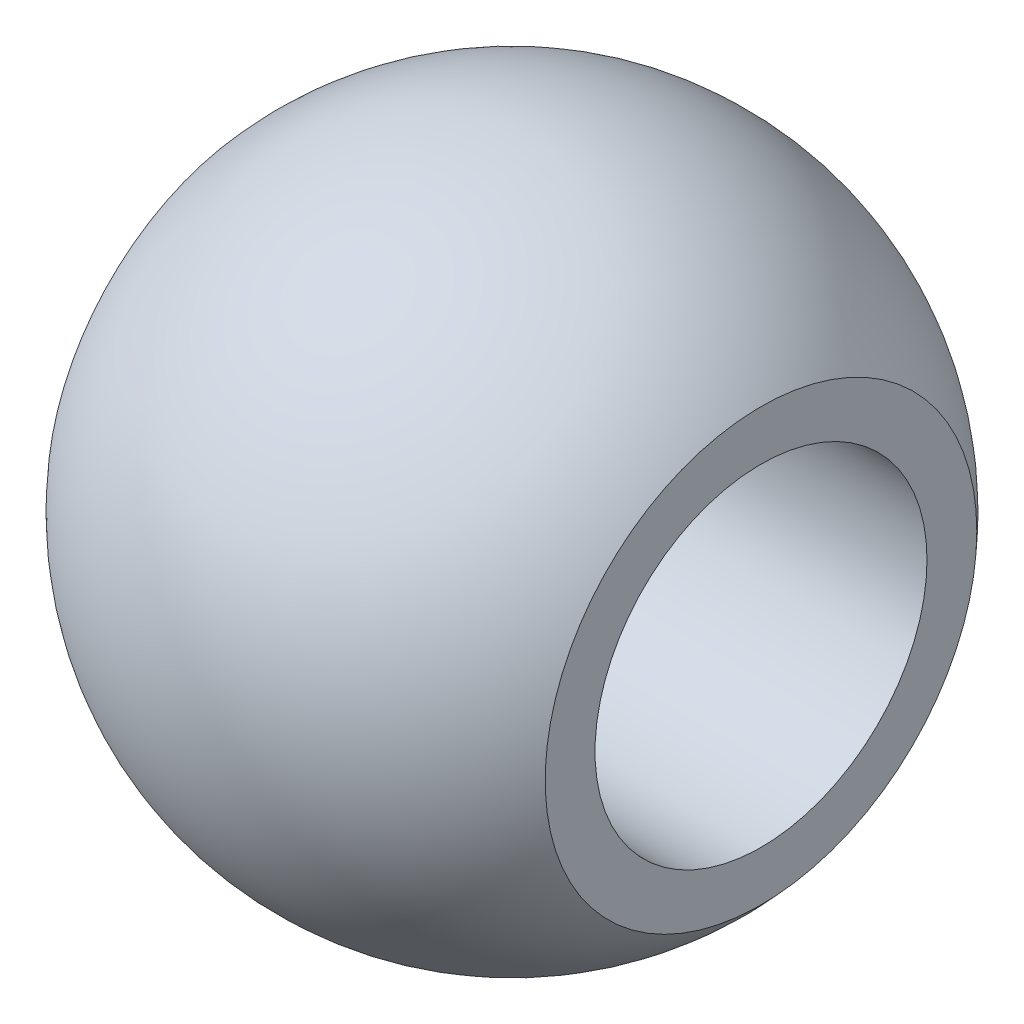
ISO-10303-21;
HEADER;
FILE_DESCRIPTION(('STEP AP214'),'2;1');
FILE_NAME('part.step','',(''),(''),'','','');
FILE_SCHEMA(('AUTOMOTIVE_DESIGN { 1 0 10303 214 1 1 1 1 }'));
ENDSEC;
DATA;
#1=APPLICATION_CONTEXT('core data for automotive mechanical design processes');
#2=APPLICATION_PROTOCOL_DEFINITION('international standard','automotive_design',2000,#1);
#3=PRODUCT_CONTEXT('',#1,'mechanical');
#4=PRODUCT('Part','Part','',(#3));
#5=PRODUCT_RELATED_PRODUCT_CATEGORY('part','',(#4));
#6=PRODUCT_DEFINITION_FORMATION('','',#4);
#7=PRODUCT_DEFINITION_CONTEXT('part definition',#1,'design');
#8=PRODUCT_DEFINITION('design','',#6,#7);
#9=PRODUCT_DEFINITION_SHAPE('','',#8);
#10=(LENGTH_UNIT() NAMED_UNIT(*) SI_UNIT(.MILLI.,.METRE.));
#11=(NAMED_UNIT(*) PLANE_ANGLE_UNIT() SI_UNIT($,.RADIAN.));
#12=(NAMED_UNIT(*) SI_UNIT($,.STERADIAN.) SOLID_ANGLE_UNIT());
#13=UNCERTAINTY_MEASURE_WITH_UNIT(LENGTH_MEASURE(1.E-05),#10,'distance_accuracy_value','');
#14=(GEOMETRIC_REPRESENTATION_CONTEXT(3) GLOBAL_UNCERTAINTY_ASSIGNED_CONTEXT((#13)) GLOBAL_UNIT_ASSIGNED_CONTEXT((#10,
#11,#12)) REPRESENTATION_CONTEXT('',''));
#15=CARTESIAN_POINT('',(0.,0.,0.));
#16=DIRECTION('',(0.,0.,1.));
#17=DIRECTION('',(1.,0.,0.));
#18=AXIS2_PLACEMENT_3D('',#15,#16,#17);
#19=CARTESIAN_POINT('',(6.,0.,-3.99999999999999));
#20=DIRECTION('',(1.,0.,0.));
#21=DIRECTION('',(0.,0.,-1.));
#22=AXIS2_PLACEMENT_3D('',#19,#20,#21);
#23=PLANE('',#22);
#24=CARTESIAN_POINT('',(6.,0.,0.));
#25=DIRECTION('',(1.,0.,0.));
#26=DIRECTION('',(0.,0.,-1.));
#27=AXIS2_PLACEMENT_3D('',#24,#25,#26);
#28=CIRCLE('',#27,5.20034614232554);
#29=CARTESIAN_POINT('',(6.,0.,-5.20034614232553));
#30=VERTEX_POINT('',#29);
#31=EDGE_CURVE('E44',#30,#30,#28,.T.);
#32=ORIENTED_EDGE('',*,*,#31,.T.);
#33=EDGE_LOOP('',(#32));
#34=FACE_BOUND('',#33,.T.);
#35=CARTESIAN_POINT('',(6.,0.,0.));
#36=DIRECTION('',(1.,0.,0.));
#37=DIRECTION('',(0.,0.,-1.));
#38=AXIS2_PLACEMENT_3D('',#35,#36,#37);
#39=CIRCLE('',#38,4.);
#40=CARTESIAN_POINT('',(6.,0.,-3.99999999999999));
#41=VERTEX_POINT('',#40);
#42=EDGE_CURVE('E10',#41,#41,#39,.T.);
#43=ORIENTED_EDGE('',*,*,#42,.F.);
#44=EDGE_LOOP('',(#43));
#45=FACE_BOUND('',#44,.T.);
#46=ADVANCED_FACE('F30',(#34,#45),#23,.T.);
#47=CARTESIAN_POINT('',(6.,0.,0.));
#48=DIRECTION('',(1.,0.,0.));
#49=DIRECTION('',(0.,0.,-1.));
#50=AXIS2_PLACEMENT_3D('',#47,#48,#49);
#51=CYLINDRICAL_SURFACE('',#50,4.);
#52=ORIENTED_EDGE('',*,*,#42,.T.);
#53=EDGE_LOOP('',(#52));
#54=FACE_BOUND('',#53,.T.);
#55=CARTESIAN_POINT('',(-6.,0.,0.));
#56=DIRECTION('',(1.,0.,0.));
#57=DIRECTION('',(0.,0.,-1.));
#58=AXIS2_PLACEMENT_3D('',#55,#56,#57);
#59=CIRCLE('',#58,4.);
#60=CARTESIAN_POINT('',(-6.,0.,-3.99999999999999));
#61=VERTEX_POINT('',#60);
#62=EDGE_CURVE('E36',#61,#61,#59,.T.);
#63=ORIENTED_EDGE('',*,*,#62,.F.);
#64=EDGE_LOOP('',(#63));
#65=FACE_BOUND('',#64,.T.);
#66=ADVANCED_FACE('F60',(#54,#65),#51,.F.);
#67=CARTESIAN_POINT('',(-6.,0.,-3.99999999999999));
#68=DIRECTION('',(-1.,0.,0.));
#69=DIRECTION('',(0.,0.,1.));
#70=AXIS2_PLACEMENT_3D('',#67,#68,#69);
#71=PLANE('',#70);
#72=ORIENTED_EDGE('',*,*,#62,.T.);
#73=EDGE_LOOP('',(#72));
#74=FACE_BOUND('',#73,.T.);
#75=CARTESIAN_POINT('',(-6.,0.,0.));
#76=DIRECTION('',(1.,0.,0.));
#77=DIRECTION('',(0.,0.,-1.));
#78=AXIS2_PLACEMENT_3D('',#75,#76,#77);
#79=CIRCLE('',#78,5.20034614232553);
#80=CARTESIAN_POINT('',(-6.,0.,-5.20034614232553));
#81=VERTEX_POINT('',#80);
#82=EDGE_CURVE('E40',#81,#81,#79,.T.);
#83=ORIENTED_EDGE('',*,*,#82,.F.);
#84=EDGE_LOOP('',(#83));
#85=FACE_BOUND('',#84,.T.);
#86=ADVANCED_FACE('F54',(#74,#85),#71,.T.);
#87=CARTESIAN_POINT('',(0.,0.,0.));
#88=DIRECTION('',(1.,0.,0.));
#89=DIRECTION('',(0.,0.,-1.));
#90=AXIS2_PLACEMENT_3D('',#87,#88,#89);
#91=SPHERICAL_SURFACE('',#90,7.94);
#92=ORIENTED_EDGE('',*,*,#82,.T.);
#93=EDGE_LOOP('',(#92));
#94=FACE_BOUND('',#93,.T.);
#95=ORIENTED_EDGE('',*,*,#31,.F.);
#96=EDGE_LOOP('',(#95));
#97=FACE_BOUND('',#96,.T.);
#98=ADVANCED_FACE('F52',(#94,#97),#91,.T.);
#99=CLOSED_SHELL('',(#46,#66,#86,#98));
#100=MANIFOLD_SOLID_BREP('B2',#99);
#101=ADVANCED_BREP_SHAPE_REPRESENTATION('',(#18,#100),#14);
#102=SHAPE_DEFINITION_REPRESENTATION(#9,#101);
ENDSEC;
END-ISO-10303-21;
